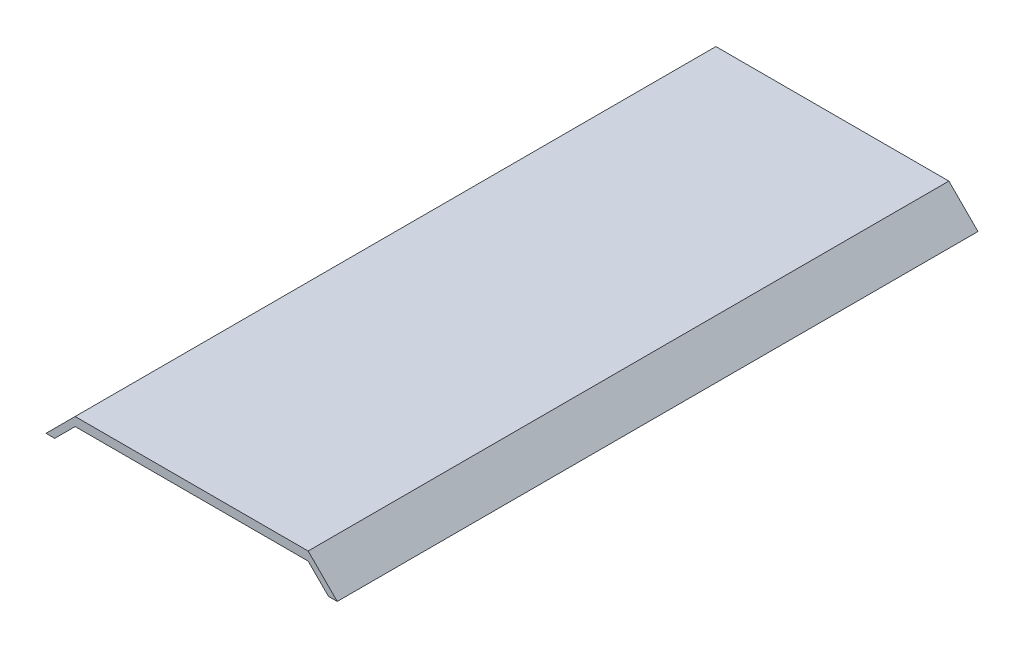
ISO-10303-21;
HEADER;
FILE_DESCRIPTION(('STEP AP214'),'2;1');
FILE_NAME('part.step','',(''),(''),'','','');
FILE_SCHEMA(('AUTOMOTIVE_DESIGN { 1 0 10303 214 1 1 1 1 }'));
ENDSEC;
DATA;
#1=APPLICATION_CONTEXT('core data for automotive mechanical design processes');
#2=APPLICATION_PROTOCOL_DEFINITION('international standard','automotive_design',2000,#1);
#3=PRODUCT_CONTEXT('',#1,'mechanical');
#4=PRODUCT('Part','Part','',(#3));
#5=PRODUCT_RELATED_PRODUCT_CATEGORY('part','',(#4));
#6=PRODUCT_DEFINITION_FORMATION('','',#4);
#7=PRODUCT_DEFINITION_CONTEXT('part definition',#1,'design');
#8=PRODUCT_DEFINITION('design','',#6,#7);
#9=PRODUCT_DEFINITION_SHAPE('','',#8);
#10=(LENGTH_UNIT() NAMED_UNIT(*) SI_UNIT(.MILLI.,.METRE.));
#11=(NAMED_UNIT(*) PLANE_ANGLE_UNIT() SI_UNIT($,.RADIAN.));
#12=(NAMED_UNIT(*) SI_UNIT($,.STERADIAN.) SOLID_ANGLE_UNIT());
#13=UNCERTAINTY_MEASURE_WITH_UNIT(LENGTH_MEASURE(1.E-05),#10,'distance_accuracy_value','');
#14=(GEOMETRIC_REPRESENTATION_CONTEXT(3) GLOBAL_UNCERTAINTY_ASSIGNED_CONTEXT((#13)) GLOBAL_UNIT_ASSIGNED_CONTEXT((#10,
#11,#12)) REPRESENTATION_CONTEXT('',''));
#15=CARTESIAN_POINT('',(0.,0.,0.));
#16=DIRECTION('',(0.,0.,1.));
#17=DIRECTION('',(1.,0.,0.));
#18=AXIS2_PLACEMENT_3D('',#15,#16,#17);
#19=CARTESIAN_POINT('',(40.,7.,220.));
#20=DIRECTION('',(0.70710678118655,0.707106781186545,0.));
#21=DIRECTION('',(-0.707106781186545,0.70710678118655,0.));
#22=AXIS2_PLACEMENT_3D('',#19,#20,#21);
#23=PLANE('',#22);
#24=DIRECTION('',(0.707106781186545,-0.70710678118655,0.));
#25=VECTOR('',#24,1.);
#26=CARTESIAN_POINT('',(40.,7.,0.));
#27=LINE('',#26,#25);
#28=CARTESIAN_POINT('',(40.,7.,0.));
#29=VERTEX_POINT('',#28);
#30=CARTESIAN_POINT('',(47.,0.,0.));
#31=VERTEX_POINT('',#30);
#32=EDGE_CURVE('E132',#29,#31,#27,.T.);
#33=ORIENTED_EDGE('',*,*,#32,.T.);
#34=DIRECTION('',(0.,0.,-1.));
#35=VECTOR('',#34,1.);
#36=CARTESIAN_POINT('',(47.,0.,220.));
#37=LINE('',#36,#35);
#38=CARTESIAN_POINT('',(47.,0.,220.));
#39=VERTEX_POINT('',#38);
#40=EDGE_CURVE('E11',#39,#31,#37,.T.);
#41=ORIENTED_EDGE('',*,*,#40,.F.);
#42=DIRECTION('',(0.707106781186545,-0.70710678118655,0.));
#43=VECTOR('',#42,1.);
#44=CARTESIAN_POINT('',(40.,7.,220.));
#45=LINE('',#44,#43);
#46=CARTESIAN_POINT('',(40.,7.,220.));
#47=VERTEX_POINT('',#46);
#48=EDGE_CURVE('E146',#47,#39,#45,.T.);
#49=ORIENTED_EDGE('',*,*,#48,.F.);
#50=DIRECTION('',(0.,0.,-1.));
#51=VECTOR('',#50,1.);
#52=CARTESIAN_POINT('',(40.,7.,220.));
#53=LINE('',#52,#51);
#54=EDGE_CURVE('E128',#47,#29,#53,.T.);
#55=ORIENTED_EDGE('',*,*,#54,.T.);
#56=EDGE_LOOP('',(#33,#41,#49,#55));
#57=FACE_BOUND('',#56,.T.);
#58=ADVANCED_FACE('F36',(#57),#23,.F.);
#59=CARTESIAN_POINT('',(47.,0.,220.));
#60=DIRECTION('',(0.,1.,0.));
#61=DIRECTION('',(-1.,0.,0.));
#62=AXIS2_PLACEMENT_3D('',#59,#60,#61);
#63=PLANE('',#62);
#64=DIRECTION('',(1.,0.,0.));
#65=VECTOR('',#64,1.);
#66=CARTESIAN_POINT('',(47.,0.,0.));
#67=LINE('',#66,#65);
#68=CARTESIAN_POINT('',(50.,0.,0.));
#69=VERTEX_POINT('',#68);
#70=EDGE_CURVE('E135',#31,#69,#67,.T.);
#71=ORIENTED_EDGE('',*,*,#70,.T.);
#72=DIRECTION('',(0.,0.,-1.));
#73=VECTOR('',#72,1.);
#74=CARTESIAN_POINT('',(50.,0.,220.));
#75=LINE('',#74,#73);
#76=CARTESIAN_POINT('',(50.,0.,220.));
#77=VERTEX_POINT('',#76);
#78=EDGE_CURVE('E44',#77,#69,#75,.T.);
#79=ORIENTED_EDGE('',*,*,#78,.F.);
#80=DIRECTION('',(1.,0.,0.));
#81=VECTOR('',#80,1.);
#82=CARTESIAN_POINT('',(47.,0.,220.));
#83=LINE('',#82,#81);
#84=EDGE_CURVE('E95',#39,#77,#83,.T.);
#85=ORIENTED_EDGE('',*,*,#84,.F.);
#86=ORIENTED_EDGE('',*,*,#40,.T.);
#87=EDGE_LOOP('',(#71,#79,#85,#86));
#88=FACE_BOUND('',#87,.T.);
#89=ADVANCED_FACE('F181',(#88),#63,.F.);
#90=CARTESIAN_POINT('',(40.0000000000001,10.,220.));
#91=DIRECTION('',(-0.707106781186549,-0.707106781186546,0.));
#92=DIRECTION('',(0.707106781186546,-0.707106781186549,0.));
#93=AXIS2_PLACEMENT_3D('',#90,#91,#92);
#94=PLANE('',#93);
#95=DIRECTION('',(-0.707106781186546,0.707106781186549,0.));
#96=VECTOR('',#95,1.);
#97=CARTESIAN_POINT('',(40.0000000000001,10.,0.));
#98=LINE('',#97,#96);
#99=CARTESIAN_POINT('',(40.0000000000001,10.,0.));
#100=VERTEX_POINT('',#99);
#101=EDGE_CURVE('E137',#69,#100,#98,.T.);
#102=ORIENTED_EDGE('',*,*,#101,.T.);
#103=DIRECTION('',(0.,0.,-1.));
#104=VECTOR('',#103,1.);
#105=CARTESIAN_POINT('',(40.0000000000001,10.,220.));
#106=LINE('',#105,#104);
#107=CARTESIAN_POINT('',(40.0000000000001,10.,220.));
#108=VERTEX_POINT('',#107);
#109=EDGE_CURVE('E153',#108,#100,#106,.T.);
#110=ORIENTED_EDGE('',*,*,#109,.F.);
#111=DIRECTION('',(-0.707106781186546,0.707106781186549,0.));
#112=VECTOR('',#111,1.);
#113=CARTESIAN_POINT('',(40.0000000000001,10.,220.));
#114=LINE('',#113,#112);
#115=EDGE_CURVE('E161',#77,#108,#114,.T.);
#116=ORIENTED_EDGE('',*,*,#115,.F.);
#117=ORIENTED_EDGE('',*,*,#78,.T.);
#118=EDGE_LOOP('',(#102,#110,#116,#117));
#119=FACE_BOUND('',#118,.T.);
#120=ADVANCED_FACE('F159',(#119),#94,.F.);
#121=CARTESIAN_POINT('',(-39.9999999999999,10.,220.));
#122=DIRECTION('',(0.,-1.,0.));
#123=DIRECTION('',(0.,0.,-1.));
#124=AXIS2_PLACEMENT_3D('',#121,#122,#123);
#125=PLANE('',#124);
#126=DIRECTION('',(-1.,0.,0.));
#127=VECTOR('',#126,1.);
#128=CARTESIAN_POINT('',(-39.9999999999999,10.,0.));
#129=LINE('',#128,#127);
#130=CARTESIAN_POINT('',(-39.9999999999999,10.,0.));
#131=VERTEX_POINT('',#130);
#132=EDGE_CURVE('E139',#100,#131,#129,.T.);
#133=ORIENTED_EDGE('',*,*,#132,.T.);
#134=DIRECTION('',(0.,0.,-1.));
#135=VECTOR('',#134,1.);
#136=CARTESIAN_POINT('',(-39.9999999999999,10.,220.));
#137=LINE('',#136,#135);
#138=CARTESIAN_POINT('',(-39.9999999999999,10.,220.));
#139=VERTEX_POINT('',#138);
#140=EDGE_CURVE('E150',#139,#131,#137,.T.);
#141=ORIENTED_EDGE('',*,*,#140,.F.);
#142=DIRECTION('',(-1.,0.,0.));
#143=VECTOR('',#142,1.);
#144=CARTESIAN_POINT('',(-39.9999999999999,10.,220.));
#145=LINE('',#144,#143);
#146=EDGE_CURVE('E173',#108,#139,#145,.T.);
#147=ORIENTED_EDGE('',*,*,#146,.F.);
#148=ORIENTED_EDGE('',*,*,#109,.T.);
#149=EDGE_LOOP('',(#133,#141,#147,#148));
#150=FACE_BOUND('',#149,.T.);
#151=ADVANCED_FACE('F169',(#150),#125,.F.);
#152=CARTESIAN_POINT('',(-50.,0.,220.));
#153=DIRECTION('',(0.707106781186544,-0.707106781186551,0.));
#154=DIRECTION('',(0.707106781186551,0.707106781186544,0.));
#155=AXIS2_PLACEMENT_3D('',#152,#153,#154);
#156=PLANE('',#155);
#157=DIRECTION('',(-0.707106781186551,-0.707106781186544,0.));
#158=VECTOR('',#157,1.);
#159=CARTESIAN_POINT('',(-50.,0.,0.));
#160=LINE('',#159,#158);
#161=CARTESIAN_POINT('',(-50.,0.,0.));
#162=VERTEX_POINT('',#161);
#163=EDGE_CURVE('E141',#131,#162,#160,.T.);
#164=ORIENTED_EDGE('',*,*,#163,.T.);
#165=DIRECTION('',(0.,0.,-1.));
#166=VECTOR('',#165,1.);
#167=CARTESIAN_POINT('',(-50.,0.,220.));
#168=LINE('',#167,#166);
#169=CARTESIAN_POINT('',(-50.,0.,220.));
#170=VERTEX_POINT('',#169);
#171=EDGE_CURVE('E123',#170,#162,#168,.T.);
#172=ORIENTED_EDGE('',*,*,#171,.F.);
#173=DIRECTION('',(-0.707106781186551,-0.707106781186544,0.));
#174=VECTOR('',#173,1.);
#175=CARTESIAN_POINT('',(-50.,0.,220.));
#176=LINE('',#175,#174);
#177=EDGE_CURVE('E114',#139,#170,#176,.T.);
#178=ORIENTED_EDGE('',*,*,#177,.F.);
#179=ORIENTED_EDGE('',*,*,#140,.T.);
#180=EDGE_LOOP('',(#164,#172,#178,#179));
#181=FACE_BOUND('',#180,.T.);
#182=ADVANCED_FACE('F172',(#181),#156,.F.);
#183=CARTESIAN_POINT('',(-47.,0.,220.));
#184=DIRECTION('',(0.,1.,0.));
#185=DIRECTION('',(-1.,0.,0.));
#186=AXIS2_PLACEMENT_3D('',#183,#184,#185);
#187=PLANE('',#186);
#188=DIRECTION('',(1.,0.,0.));
#189=VECTOR('',#188,1.);
#190=CARTESIAN_POINT('',(-47.,0.,0.));
#191=LINE('',#190,#189);
#192=CARTESIAN_POINT('',(-47.,0.,0.));
#193=VERTEX_POINT('',#192);
#194=EDGE_CURVE('E122',#162,#193,#191,.T.);
#195=ORIENTED_EDGE('',*,*,#194,.T.);
#196=DIRECTION('',(0.,0.,-1.));
#197=VECTOR('',#196,1.);
#198=CARTESIAN_POINT('',(-47.,0.,220.));
#199=LINE('',#198,#197);
#200=CARTESIAN_POINT('',(-47.,0.,220.));
#201=VERTEX_POINT('',#200);
#202=EDGE_CURVE('E119',#201,#193,#199,.T.);
#203=ORIENTED_EDGE('',*,*,#202,.F.);
#204=DIRECTION('',(1.,0.,0.));
#205=VECTOR('',#204,1.);
#206=CARTESIAN_POINT('',(-47.,0.,220.));
#207=LINE('',#206,#205);
#208=EDGE_CURVE('E108',#170,#201,#207,.T.);
#209=ORIENTED_EDGE('',*,*,#208,.F.);
#210=ORIENTED_EDGE('',*,*,#171,.T.);
#211=EDGE_LOOP('',(#195,#203,#209,#210));
#212=FACE_BOUND('',#211,.T.);
#213=ADVANCED_FACE('F120',(#212),#187,.F.);
#214=CARTESIAN_POINT('',(-47.,0.,220.));
#215=DIRECTION('',(-0.707106781186544,0.707106781186551,0.));
#216=DIRECTION('',(-0.707106781186551,-0.707106781186544,0.));
#217=AXIS2_PLACEMENT_3D('',#214,#215,#216);
#218=PLANE('',#217);
#219=DIRECTION('',(0.707106781186551,0.707106781186544,0.));
#220=VECTOR('',#219,1.);
#221=CARTESIAN_POINT('',(-47.,0.,0.));
#222=LINE('',#221,#220);
#223=CARTESIAN_POINT('',(-39.9999999999999,7.,0.));
#224=VERTEX_POINT('',#223);
#225=EDGE_CURVE('E81',#193,#224,#222,.T.);
#226=ORIENTED_EDGE('',*,*,#225,.T.);
#227=DIRECTION('',(0.,0.,-1.));
#228=VECTOR('',#227,1.);
#229=CARTESIAN_POINT('',(-39.9999999999999,7.,220.));
#230=LINE('',#229,#228);
#231=CARTESIAN_POINT('',(-39.9999999999999,7.,220.));
#232=VERTEX_POINT('',#231);
#233=EDGE_CURVE('E124',#232,#224,#230,.T.);
#234=ORIENTED_EDGE('',*,*,#233,.F.);
#235=DIRECTION('',(0.707106781186551,0.707106781186544,0.));
#236=VECTOR('',#235,1.);
#237=CARTESIAN_POINT('',(-47.,0.,220.));
#238=LINE('',#237,#236);
#239=EDGE_CURVE('E112',#201,#232,#238,.T.);
#240=ORIENTED_EDGE('',*,*,#239,.F.);
#241=ORIENTED_EDGE('',*,*,#202,.T.);
#242=EDGE_LOOP('',(#226,#234,#240,#241));
#243=FACE_BOUND('',#242,.T.);
#244=ADVANCED_FACE('F126',(#243),#218,.F.);
#245=CARTESIAN_POINT('',(-39.9999999999999,7.,220.));
#246=DIRECTION('',(0.,1.,0.));
#247=DIRECTION('',(0.,0.,1.));
#248=AXIS2_PLACEMENT_3D('',#245,#246,#247);
#249=PLANE('',#248);
#250=DIRECTION('',(1.,0.,0.));
#251=VECTOR('',#250,1.);
#252=CARTESIAN_POINT('',(-39.9999999999999,7.,0.));
#253=LINE('',#252,#251);
#254=EDGE_CURVE('E87',#224,#29,#253,.T.);
#255=ORIENTED_EDGE('',*,*,#254,.T.);
#256=ORIENTED_EDGE('',*,*,#54,.F.);
#257=DIRECTION('',(1.,0.,0.));
#258=VECTOR('',#257,1.);
#259=CARTESIAN_POINT('',(-39.9999999999999,7.,220.));
#260=LINE('',#259,#258);
#261=EDGE_CURVE('E52',#232,#47,#260,.T.);
#262=ORIENTED_EDGE('',*,*,#261,.F.);
#263=ORIENTED_EDGE('',*,*,#233,.T.);
#264=EDGE_LOOP('',(#255,#256,#262,#263));
#265=FACE_BOUND('',#264,.T.);
#266=ADVANCED_FACE('F197',(#265),#249,.F.);
#267=CARTESIAN_POINT('',(0.,0.,220.));
#268=DIRECTION('',(0.,0.,1.));
#269=DIRECTION('',(1.,0.,0.));
#270=AXIS2_PLACEMENT_3D('',#267,#268,#269);
#271=PLANE('',#270);
#272=ORIENTED_EDGE('',*,*,#48,.T.);
#273=ORIENTED_EDGE('',*,*,#84,.T.);
#274=ORIENTED_EDGE('',*,*,#115,.T.);
#275=ORIENTED_EDGE('',*,*,#146,.T.);
#276=ORIENTED_EDGE('',*,*,#177,.T.);
#277=ORIENTED_EDGE('',*,*,#208,.T.);
#278=ORIENTED_EDGE('',*,*,#239,.T.);
#279=ORIENTED_EDGE('',*,*,#261,.T.);
#280=EDGE_LOOP('',(#272,#273,#274,#275,#276,#277,#278,#279));
#281=FACE_BOUND('',#280,.T.);
#282=ADVANCED_FACE('F110',(#281),#271,.T.);
#283=CARTESIAN_POINT('',(0.,0.,0.));
#284=DIRECTION('',(0.,0.,1.));
#285=DIRECTION('',(1.,0.,0.));
#286=AXIS2_PLACEMENT_3D('',#283,#284,#285);
#287=PLANE('',#286);
#288=ORIENTED_EDGE('',*,*,#32,.F.);
#289=ORIENTED_EDGE('',*,*,#254,.F.);
#290=ORIENTED_EDGE('',*,*,#225,.F.);
#291=ORIENTED_EDGE('',*,*,#194,.F.);
#292=ORIENTED_EDGE('',*,*,#163,.F.);
#293=ORIENTED_EDGE('',*,*,#132,.F.);
#294=ORIENTED_EDGE('',*,*,#101,.F.);
#295=ORIENTED_EDGE('',*,*,#70,.F.);
#296=EDGE_LOOP('',(#288,#289,#290,#291,#292,#293,#294,#295));
#297=FACE_BOUND('',#296,.T.);
#298=ADVANCED_FACE('F165',(#297),#287,.F.);
#299=CLOSED_SHELL('',(#58,#89,#120,#151,#182,#213,#244,#266,#282,#298));
#300=MANIFOLD_SOLID_BREP('B2',#299);
#301=ADVANCED_BREP_SHAPE_REPRESENTATION('',(#18,#300),#14);
#302=SHAPE_DEFINITION_REPRESENTATION(#9,#301);
ENDSEC;
END-ISO-10303-21;
